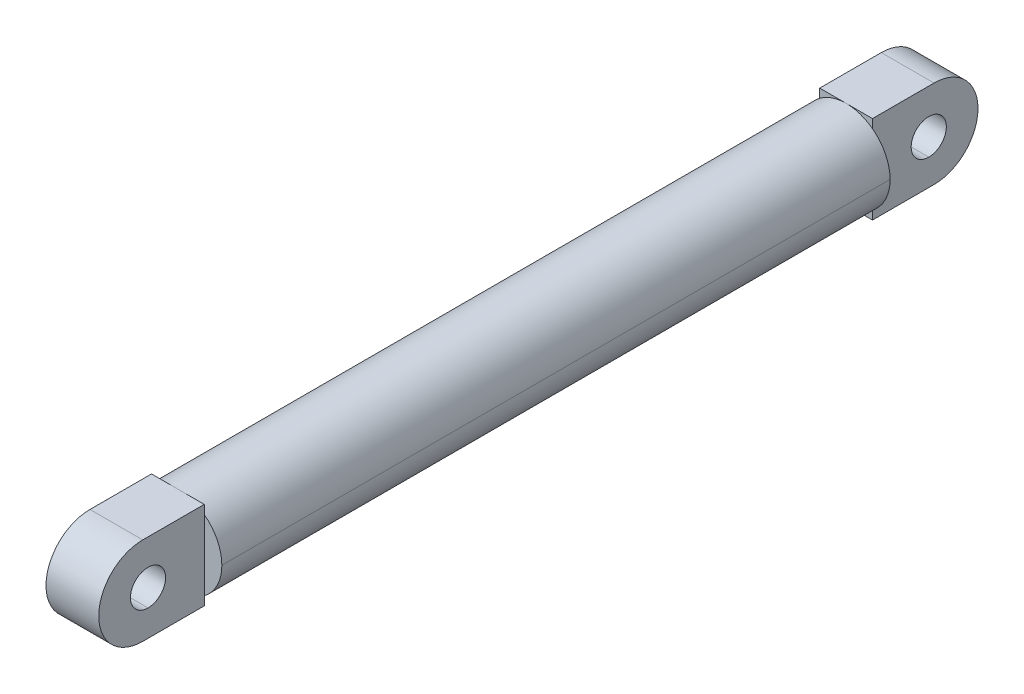
ISO-10303-21;
HEADER;
FILE_DESCRIPTION(('STEP AP214'),'2;1');
FILE_NAME('part.step','',(''),(''),'','','');
FILE_SCHEMA(('AUTOMOTIVE_DESIGN { 1 0 10303 214 1 1 1 1 }'));
ENDSEC;
DATA;
#1=APPLICATION_CONTEXT('core data for automotive mechanical design processes');
#2=APPLICATION_PROTOCOL_DEFINITION('international standard','automotive_design',2000,#1);
#3=PRODUCT_CONTEXT('',#1,'mechanical');
#4=PRODUCT('Part','Part','',(#3));
#5=PRODUCT_RELATED_PRODUCT_CATEGORY('part','',(#4));
#6=PRODUCT_DEFINITION_FORMATION('','',#4);
#7=PRODUCT_DEFINITION_CONTEXT('part definition',#1,'design');
#8=PRODUCT_DEFINITION('design','',#6,#7);
#9=PRODUCT_DEFINITION_SHAPE('','',#8);
#10=(LENGTH_UNIT() NAMED_UNIT(*) SI_UNIT(.MILLI.,.METRE.));
#11=(NAMED_UNIT(*) PLANE_ANGLE_UNIT() SI_UNIT($,.RADIAN.));
#12=(NAMED_UNIT(*) SI_UNIT($,.STERADIAN.) SOLID_ANGLE_UNIT());
#13=UNCERTAINTY_MEASURE_WITH_UNIT(LENGTH_MEASURE(1.E-05),#10,'distance_accuracy_value','');
#14=(GEOMETRIC_REPRESENTATION_CONTEXT(3) GLOBAL_UNCERTAINTY_ASSIGNED_CONTEXT((#13)) GLOBAL_UNIT_ASSIGNED_CONTEXT((#10,
#11,#12)) REPRESENTATION_CONTEXT('',''));
#15=CARTESIAN_POINT('',(0.,0.,0.));
#16=DIRECTION('',(0.,0.,1.));
#17=DIRECTION('',(1.,0.,0.));
#18=AXIS2_PLACEMENT_3D('',#15,#16,#17);
#19=CARTESIAN_POINT('',(-30.0000000000001,0.,28.));
#20=DIRECTION('',(1.,0.,0.));
#21=DIRECTION('',(0.,-1.,0.));
#22=AXIS2_PLACEMENT_3D('',#19,#20,#21);
#23=CYLINDRICAL_SURFACE('',#22,10.);
#24=DIRECTION('',(1.,0.,0.));
#25=VECTOR('',#24,1.);
#26=CARTESIAN_POINT('',(-15.,10.,28.));
#27=LINE('',#26,#25);
#28=CARTESIAN_POINT('',(-15.,10.,28.));
#29=VERTEX_POINT('',#28);
#30=CARTESIAN_POINT('',(15.,10.,28.));
#31=VERTEX_POINT('',#30);
#32=EDGE_CURVE('E20',#29,#31,#27,.T.);
#33=ORIENTED_EDGE('',*,*,#32,.T.);
#34=CARTESIAN_POINT('',(15.,0.,28.));
#35=DIRECTION('',(1.,0.,0.));
#36=DIRECTION('',(0.,1.,0.));
#37=AXIS2_PLACEMENT_3D('',#34,#35,#36);
#38=CIRCLE('',#37,10.);
#39=CARTESIAN_POINT('',(15.,-10.,28.));
#40=VERTEX_POINT('',#39);
#41=EDGE_CURVE('E295',#31,#40,#38,.T.);
#42=ORIENTED_EDGE('',*,*,#41,.T.);
#43=DIRECTION('',(1.,0.,0.));
#44=VECTOR('',#43,1.);
#45=CARTESIAN_POINT('',(-15.,-10.,28.));
#46=LINE('',#45,#44);
#47=CARTESIAN_POINT('',(-15.,-10.,28.));
#48=VERTEX_POINT('',#47);
#49=EDGE_CURVE('E11',#48,#40,#46,.T.);
#50=ORIENTED_EDGE('',*,*,#49,.F.);
#51=CARTESIAN_POINT('',(-15.,0.,28.));
#52=DIRECTION('',(1.,0.,0.));
#53=DIRECTION('',(0.,1.,0.));
#54=AXIS2_PLACEMENT_3D('',#51,#52,#53);
#55=CIRCLE('',#54,10.);
#56=EDGE_CURVE('E311',#29,#48,#55,.T.);
#57=ORIENTED_EDGE('',*,*,#56,.F.);
#58=EDGE_LOOP('',(#33,#42,#50,#57));
#59=FACE_BOUND('',#58,.T.);
#60=ADVANCED_FACE('F17',(#59),#23,.F.);
#61=CARTESIAN_POINT('',(-30.0000000000001,0.,28.));
#62=DIRECTION('',(1.,0.,0.));
#63=DIRECTION('',(0.,-1.,0.));
#64=AXIS2_PLACEMENT_3D('',#61,#62,#63);
#65=CYLINDRICAL_SURFACE('',#64,10.);
#66=ORIENTED_EDGE('',*,*,#49,.T.);
#67=CARTESIAN_POINT('',(15.,0.,28.));
#68=DIRECTION('',(1.,0.,0.));
#69=DIRECTION('',(0.,-1.,0.));
#70=AXIS2_PLACEMENT_3D('',#67,#68,#69);
#71=CIRCLE('',#70,10.);
#72=EDGE_CURVE('E303',#40,#31,#71,.T.);
#73=ORIENTED_EDGE('',*,*,#72,.T.);
#74=ORIENTED_EDGE('',*,*,#32,.F.);
#75=CARTESIAN_POINT('',(-15.,0.,28.));
#76=DIRECTION('',(1.,0.,0.));
#77=DIRECTION('',(0.,-1.,0.));
#78=AXIS2_PLACEMENT_3D('',#75,#76,#77);
#79=CIRCLE('',#78,10.);
#80=EDGE_CURVE('E320',#48,#29,#79,.T.);
#81=ORIENTED_EDGE('',*,*,#80,.F.);
#82=EDGE_LOOP('',(#66,#73,#74,#81));
#83=FACE_BOUND('',#82,.T.);
#84=ADVANCED_FACE('F341',(#83),#65,.F.);
#85=CARTESIAN_POINT('',(-25.,25.,60.));
#86=DIRECTION('',(0.,0.,1.));
#87=DIRECTION('',(0.,-1.,0.));
#88=AXIS2_PLACEMENT_3D('',#85,#86,#87);
#89=PLANE('',#88);
#90=CARTESIAN_POINT('',(0.,0.,60.));
#91=DIRECTION('',(0.,0.,1.));
#92=DIRECTION('',(0.,-1.,0.));
#93=AXIS2_PLACEMENT_3D('',#90,#91,#92);
#94=CIRCLE('',#93,25.);
#95=CARTESIAN_POINT('',(0.,-25.,60.));
#96=VERTEX_POINT('',#95);
#97=CARTESIAN_POINT('',(15.,-20.,60.));
#98=VERTEX_POINT('',#97);
#99=EDGE_CURVE('E219',#96,#98,#94,.T.);
#100=ORIENTED_EDGE('',*,*,#99,.F.);
#101=DIRECTION('',(1.,0.,0.));
#102=VECTOR('',#101,1.);
#103=CARTESIAN_POINT('',(0.,-25.,60.));
#104=LINE('',#103,#102);
#105=CARTESIAN_POINT('',(15.,-25.,60.));
#106=VERTEX_POINT('',#105);
#107=EDGE_CURVE('E323',#96,#106,#104,.T.);
#108=ORIENTED_EDGE('',*,*,#107,.T.);
#109=DIRECTION('',(0.,-1.,0.));
#110=VECTOR('',#109,1.);
#111=CARTESIAN_POINT('',(15.,-20.,60.));
#112=LINE('',#111,#110);
#113=EDGE_CURVE('E308',#98,#106,#112,.T.);
#114=ORIENTED_EDGE('',*,*,#113,.F.);
#115=EDGE_LOOP('',(#100,#108,#114));
#116=FACE_BOUND('',#115,.T.);
#117=ADVANCED_FACE('F404',(#116),#89,.T.);
#118=CARTESIAN_POINT('',(-25.,-25.,60.));
#119=DIRECTION('',(0.,-1.,0.));
#120=DIRECTION('',(0.,0.,-1.));
#121=AXIS2_PLACEMENT_3D('',#118,#119,#120);
#122=PLANE('',#121);
#123=DIRECTION('',(0.,0.,-1.));
#124=VECTOR('',#123,1.);
#125=CARTESIAN_POINT('',(15.,-25.,60.));
#126=LINE('',#125,#124);
#127=CARTESIAN_POINT('',(15.,-25.,25.));
#128=VERTEX_POINT('',#127);
#129=EDGE_CURVE('E291',#106,#128,#126,.T.);
#130=ORIENTED_EDGE('',*,*,#129,.F.);
#131=ORIENTED_EDGE('',*,*,#107,.F.);
#132=DIRECTION('',(1.,0.,0.));
#133=VECTOR('',#132,1.);
#134=CARTESIAN_POINT('',(-15.,-25.,60.));
#135=LINE('',#134,#133);
#136=CARTESIAN_POINT('',(-15.,-25.,60.));
#137=VERTEX_POINT('',#136);
#138=EDGE_CURVE('E314',#137,#96,#135,.T.);
#139=ORIENTED_EDGE('',*,*,#138,.F.);
#140=DIRECTION('',(0.,0.,-1.));
#141=VECTOR('',#140,1.);
#142=CARTESIAN_POINT('',(-15.,-25.,60.));
#143=LINE('',#142,#141);
#144=CARTESIAN_POINT('',(-15.,-25.,25.));
#145=VERTEX_POINT('',#144);
#146=EDGE_CURVE('E316',#137,#145,#143,.T.);
#147=ORIENTED_EDGE('',*,*,#146,.T.);
#148=DIRECTION('',(-1.,0.,0.));
#149=VECTOR('',#148,1.);
#150=CARTESIAN_POINT('',(15.,-25.,25.));
#151=LINE('',#150,#149);
#152=EDGE_CURVE('E294',#128,#145,#151,.T.);
#153=ORIENTED_EDGE('',*,*,#152,.F.);
#154=EDGE_LOOP('',(#130,#131,#139,#147,#153));
#155=FACE_BOUND('',#154,.T.);
#156=ADVANCED_FACE('F356',(#155),#122,.T.);
#157=CARTESIAN_POINT('',(-25.,25.,60.));
#158=DIRECTION('',(0.,0.,1.));
#159=DIRECTION('',(0.,-1.,0.));
#160=AXIS2_PLACEMENT_3D('',#157,#158,#159);
#161=PLANE('',#160);
#162=ORIENTED_EDGE('',*,*,#138,.T.);
#163=CARTESIAN_POINT('',(0.,0.,60.));
#164=DIRECTION('',(0.,0.,1.));
#165=DIRECTION('',(-0.6,-0.8,0.));
#166=AXIS2_PLACEMENT_3D('',#163,#164,#165);
#167=CIRCLE('',#166,25.);
#168=CARTESIAN_POINT('',(-15.,-20.,60.));
#169=VERTEX_POINT('',#168);
#170=EDGE_CURVE('E222',#169,#96,#167,.T.);
#171=ORIENTED_EDGE('',*,*,#170,.F.);
#172=DIRECTION('',(0.,-1.,0.));
#173=VECTOR('',#172,1.);
#174=CARTESIAN_POINT('',(-15.,-20.,60.));
#175=LINE('',#174,#173);
#176=EDGE_CURVE('E163',#169,#137,#175,.T.);
#177=ORIENTED_EDGE('',*,*,#176,.T.);
#178=EDGE_LOOP('',(#162,#171,#177));
#179=FACE_BOUND('',#178,.T.);
#180=ADVANCED_FACE('F359',(#179),#161,.T.);
#181=CARTESIAN_POINT('',(-25.,25.,60.));
#182=DIRECTION('',(0.,0.,1.));
#183=DIRECTION('',(0.,-1.,0.));
#184=AXIS2_PLACEMENT_3D('',#181,#182,#183);
#185=PLANE('',#184);
#186=CARTESIAN_POINT('',(0.,0.,60.));
#187=DIRECTION('',(0.,0.,1.));
#188=DIRECTION('',(0.,1.,0.));
#189=AXIS2_PLACEMENT_3D('',#186,#187,#188);
#190=CIRCLE('',#189,25.);
#191=CARTESIAN_POINT('',(0.,25.,60.));
#192=VERTEX_POINT('',#191);
#193=CARTESIAN_POINT('',(-15.,20.,60.));
#194=VERTEX_POINT('',#193);
#195=EDGE_CURVE('E156',#192,#194,#190,.T.);
#196=ORIENTED_EDGE('',*,*,#195,.F.);
#197=DIRECTION('',(1.,0.,0.));
#198=VECTOR('',#197,1.);
#199=CARTESIAN_POINT('',(-15.,25.,60.));
#200=LINE('',#199,#198);
#201=CARTESIAN_POINT('',(-15.,25.,60.));
#202=VERTEX_POINT('',#201);
#203=EDGE_CURVE('E159',#202,#192,#200,.T.);
#204=ORIENTED_EDGE('',*,*,#203,.F.);
#205=DIRECTION('',(0.,-1.,0.));
#206=VECTOR('',#205,1.);
#207=CARTESIAN_POINT('',(-15.,25.,60.));
#208=LINE('',#207,#206);
#209=EDGE_CURVE('E152',#202,#194,#208,.T.);
#210=ORIENTED_EDGE('',*,*,#209,.T.);
#211=EDGE_LOOP('',(#196,#204,#210));
#212=FACE_BOUND('',#211,.T.);
#213=ADVANCED_FACE('F154',(#212),#185,.T.);
#214=CARTESIAN_POINT('',(-25.,25.,60.));
#215=DIRECTION('',(0.,0.,1.));
#216=DIRECTION('',(0.,-1.,0.));
#217=AXIS2_PLACEMENT_3D('',#214,#215,#216);
#218=PLANE('',#217);
#219=DIRECTION('',(1.,0.,0.));
#220=VECTOR('',#219,1.);
#221=CARTESIAN_POINT('',(0.,25.,60.));
#222=LINE('',#221,#220);
#223=CARTESIAN_POINT('',(15.,25.,60.));
#224=VERTEX_POINT('',#223);
#225=EDGE_CURVE('E309',#192,#224,#222,.T.);
#226=ORIENTED_EDGE('',*,*,#225,.F.);
#227=CARTESIAN_POINT('',(0.,0.,60.));
#228=DIRECTION('',(0.,0.,1.));
#229=DIRECTION('',(0.6,0.8,0.));
#230=AXIS2_PLACEMENT_3D('',#227,#228,#229);
#231=CIRCLE('',#230,25.);
#232=CARTESIAN_POINT('',(15.,20.,60.));
#233=VERTEX_POINT('',#232);
#234=EDGE_CURVE('E188',#233,#192,#231,.T.);
#235=ORIENTED_EDGE('',*,*,#234,.F.);
#236=DIRECTION('',(0.,-1.,0.));
#237=VECTOR('',#236,1.);
#238=CARTESIAN_POINT('',(15.,25.,60.));
#239=LINE('',#238,#237);
#240=EDGE_CURVE('E304',#224,#233,#239,.T.);
#241=ORIENTED_EDGE('',*,*,#240,.F.);
#242=EDGE_LOOP('',(#226,#235,#241));
#243=FACE_BOUND('',#242,.T.);
#244=ADVANCED_FACE('F452',(#243),#218,.T.);
#245=CARTESIAN_POINT('',(-25.,25.,0.));
#246=DIRECTION('',(0.,1.,0.));
#247=DIRECTION('',(0.,0.,1.));
#248=AXIS2_PLACEMENT_3D('',#245,#246,#247);
#249=PLANE('',#248);
#250=DIRECTION('',(0.,0.,1.));
#251=VECTOR('',#250,1.);
#252=CARTESIAN_POINT('',(-15.,25.,25.));
#253=LINE('',#252,#251);
#254=CARTESIAN_POINT('',(-15.,25.,25.));
#255=VERTEX_POINT('',#254);
#256=EDGE_CURVE('E164',#255,#202,#253,.T.);
#257=ORIENTED_EDGE('',*,*,#256,.T.);
#258=ORIENTED_EDGE('',*,*,#203,.T.);
#259=ORIENTED_EDGE('',*,*,#225,.T.);
#260=DIRECTION('',(0.,0.,1.));
#261=VECTOR('',#260,1.);
#262=CARTESIAN_POINT('',(15.,25.,25.));
#263=LINE('',#262,#261);
#264=CARTESIAN_POINT('',(15.,25.,25.));
#265=VERTEX_POINT('',#264);
#266=EDGE_CURVE('E300',#265,#224,#263,.T.);
#267=ORIENTED_EDGE('',*,*,#266,.F.);
#268=DIRECTION('',(1.,0.,0.));
#269=VECTOR('',#268,1.);
#270=CARTESIAN_POINT('',(-15.,25.,25.));
#271=LINE('',#270,#269);
#272=EDGE_CURVE('E297',#255,#265,#271,.T.);
#273=ORIENTED_EDGE('',*,*,#272,.F.);
#274=EDGE_LOOP('',(#257,#258,#259,#267,#273));
#275=FACE_BOUND('',#274,.T.);
#276=ADVANCED_FACE('F351',(#275),#249,.T.);
#277=CARTESIAN_POINT('',(-15.,30.,60.));
#278=DIRECTION('',(1.,0.,0.));
#279=DIRECTION('',(0.,0.,-1.));
#280=AXIS2_PLACEMENT_3D('',#277,#278,#279);
#281=PLANE('',#280);
#282=ORIENTED_EDGE('',*,*,#56,.T.);
#283=ORIENTED_EDGE('',*,*,#80,.T.);
#284=EDGE_LOOP('',(#282,#283));
#285=FACE_BOUND('',#284,.T.);
#286=ORIENTED_EDGE('',*,*,#146,.F.);
#287=ORIENTED_EDGE('',*,*,#176,.F.);
#288=DIRECTION('',(0.,-1.,0.));
#289=VECTOR('',#288,1.);
#290=CARTESIAN_POINT('',(-15.,20.,60.));
#291=LINE('',#290,#289);
#292=EDGE_CURVE('E168',#194,#169,#291,.T.);
#293=ORIENTED_EDGE('',*,*,#292,.F.);
#294=ORIENTED_EDGE('',*,*,#209,.F.);
#295=ORIENTED_EDGE('',*,*,#256,.F.);
#296=CARTESIAN_POINT('',(-15.,0.,25.));
#297=DIRECTION('',(1.,0.,0.));
#298=DIRECTION('',(0.,-1.,0.));
#299=AXIS2_PLACEMENT_3D('',#296,#297,#298);
#300=CIRCLE('',#299,25.);
#301=EDGE_CURVE('E292',#145,#255,#300,.T.);
#302=ORIENTED_EDGE('',*,*,#301,.F.);
#303=EDGE_LOOP('',(#286,#287,#293,#294,#295,#302));
#304=FACE_BOUND('',#303,.T.);
#305=ADVANCED_FACE('F171',(#285,#304),#281,.F.);
#306=CARTESIAN_POINT('',(-90.1800000000001,0.,25.));
#307=DIRECTION('',(1.,0.,0.));
#308=DIRECTION('',(0.,0.,-1.));
#309=AXIS2_PLACEMENT_3D('',#306,#307,#308);
#310=CYLINDRICAL_SURFACE('',#309,25.);
#311=ORIENTED_EDGE('',*,*,#272,.T.);
#312=CARTESIAN_POINT('',(15.,0.,25.));
#313=DIRECTION('',(-1.,0.,0.));
#314=DIRECTION('',(0.,1.,0.));
#315=AXIS2_PLACEMENT_3D('',#312,#313,#314);
#316=CIRCLE('',#315,25.);
#317=EDGE_CURVE('E288',#265,#128,#316,.T.);
#318=ORIENTED_EDGE('',*,*,#317,.T.);
#319=ORIENTED_EDGE('',*,*,#152,.T.);
#320=ORIENTED_EDGE('',*,*,#301,.T.);
#321=EDGE_LOOP('',(#311,#318,#319,#320));
#322=FACE_BOUND('',#321,.T.);
#323=ADVANCED_FACE('F346',(#322),#310,.T.);
#324=CARTESIAN_POINT('',(15.,30.,0.));
#325=DIRECTION('',(-1.,0.,0.));
#326=DIRECTION('',(0.,0.,1.));
#327=AXIS2_PLACEMENT_3D('',#324,#325,#326);
#328=PLANE('',#327);
#329=ORIENTED_EDGE('',*,*,#41,.F.);
#330=ORIENTED_EDGE('',*,*,#72,.F.);
#331=EDGE_LOOP('',(#329,#330));
#332=FACE_BOUND('',#331,.T.);
#333=ORIENTED_EDGE('',*,*,#266,.T.);
#334=ORIENTED_EDGE('',*,*,#240,.T.);
#335=DIRECTION('',(0.,-1.,0.));
#336=VECTOR('',#335,1.);
#337=CARTESIAN_POINT('',(15.,20.,60.));
#338=LINE('',#337,#336);
#339=EDGE_CURVE('E284',#233,#98,#338,.T.);
#340=ORIENTED_EDGE('',*,*,#339,.T.);
#341=ORIENTED_EDGE('',*,*,#113,.T.);
#342=ORIENTED_EDGE('',*,*,#129,.T.);
#343=ORIENTED_EDGE('',*,*,#317,.F.);
#344=EDGE_LOOP('',(#333,#334,#340,#341,#342,#343));
#345=FACE_BOUND('',#344,.T.);
#346=ADVANCED_FACE('F342',(#332,#345),#328,.F.);
#347=CARTESIAN_POINT('',(15.,30.,60.));
#348=DIRECTION('',(0.,0.,1.));
#349=DIRECTION('',(1.,0.,0.));
#350=AXIS2_PLACEMENT_3D('',#347,#348,#349);
#351=PLANE('',#350);
#352=CARTESIAN_POINT('',(0.,0.,60.));
#353=DIRECTION('',(0.,0.,1.));
#354=DIRECTION('',(0.6,-0.8,0.));
#355=AXIS2_PLACEMENT_3D('',#352,#353,#354);
#356=CIRCLE('',#355,25.);
#357=CARTESIAN_POINT('',(25.,0.,60.));
#358=VERTEX_POINT('',#357);
#359=EDGE_CURVE('E216',#98,#358,#356,.T.);
#360=ORIENTED_EDGE('',*,*,#359,.F.);
#361=ORIENTED_EDGE('',*,*,#339,.F.);
#362=CARTESIAN_POINT('',(0.,0.,60.));
#363=DIRECTION('',(0.,0.,1.));
#364=DIRECTION('',(1.,0.,0.));
#365=AXIS2_PLACEMENT_3D('',#362,#363,#364);
#366=CIRCLE('',#365,25.);
#367=EDGE_CURVE('E190',#358,#233,#366,.T.);
#368=ORIENTED_EDGE('',*,*,#367,.F.);
#369=EDGE_LOOP('',(#360,#361,#368));
#370=FACE_BOUND('',#369,.T.);
#371=ADVANCED_FACE('F345',(#370),#351,.F.);
#372=CARTESIAN_POINT('',(-30.0000000000001,0.,472.));
#373=DIRECTION('',(1.,0.,0.));
#374=DIRECTION('',(0.,-1.,0.));
#375=AXIS2_PLACEMENT_3D('',#372,#373,#374);
#376=CYLINDRICAL_SURFACE('',#375,10.);
#377=DIRECTION('',(1.,0.,0.));
#378=VECTOR('',#377,1.);
#379=CARTESIAN_POINT('',(-15.,-10.,472.));
#380=LINE('',#379,#378);
#381=CARTESIAN_POINT('',(-15.,-10.,472.));
#382=VERTEX_POINT('',#381);
#383=CARTESIAN_POINT('',(15.,-10.,472.));
#384=VERTEX_POINT('',#383);
#385=EDGE_CURVE('E37',#382,#384,#380,.T.);
#386=ORIENTED_EDGE('',*,*,#385,.F.);
#387=CARTESIAN_POINT('',(-15.,0.,472.));
#388=DIRECTION('',(1.,0.,0.));
#389=DIRECTION('',(0.,1.,0.));
#390=AXIS2_PLACEMENT_3D('',#387,#388,#389);
#391=CIRCLE('',#390,10.);
#392=CARTESIAN_POINT('',(-15.,10.,472.));
#393=VERTEX_POINT('',#392);
#394=EDGE_CURVE('E32',#393,#382,#391,.T.);
#395=ORIENTED_EDGE('',*,*,#394,.F.);
#396=DIRECTION('',(1.,0.,0.));
#397=VECTOR('',#396,1.);
#398=CARTESIAN_POINT('',(-15.,10.,472.));
#399=LINE('',#398,#397);
#400=CARTESIAN_POINT('',(15.,10.,472.));
#401=VERTEX_POINT('',#400);
#402=EDGE_CURVE('E279',#393,#401,#399,.T.);
#403=ORIENTED_EDGE('',*,*,#402,.T.);
#404=CARTESIAN_POINT('',(15.,0.,472.));
#405=DIRECTION('',(1.,0.,0.));
#406=DIRECTION('',(0.,1.,0.));
#407=AXIS2_PLACEMENT_3D('',#404,#405,#406);
#408=CIRCLE('',#407,10.);
#409=EDGE_CURVE('E265',#401,#384,#408,.T.);
#410=ORIENTED_EDGE('',*,*,#409,.T.);
#411=EDGE_LOOP('',(#386,#395,#403,#410));
#412=FACE_BOUND('',#411,.T.);
#413=ADVANCED_FACE('F501',(#412),#376,.F.);
#414=CARTESIAN_POINT('',(-30.0000000000001,0.,472.));
#415=DIRECTION('',(1.,0.,0.));
#416=DIRECTION('',(0.,-1.,0.));
#417=AXIS2_PLACEMENT_3D('',#414,#415,#416);
#418=CYLINDRICAL_SURFACE('',#417,10.);
#419=ORIENTED_EDGE('',*,*,#402,.F.);
#420=CARTESIAN_POINT('',(-15.,0.,472.));
#421=DIRECTION('',(1.,0.,0.));
#422=DIRECTION('',(0.,-1.,0.));
#423=AXIS2_PLACEMENT_3D('',#420,#421,#422);
#424=CIRCLE('',#423,10.);
#425=EDGE_CURVE('E238',#382,#393,#424,.T.);
#426=ORIENTED_EDGE('',*,*,#425,.F.);
#427=ORIENTED_EDGE('',*,*,#385,.T.);
#428=CARTESIAN_POINT('',(15.,0.,472.));
#429=DIRECTION('',(1.,0.,0.));
#430=DIRECTION('',(0.,-1.,0.));
#431=AXIS2_PLACEMENT_3D('',#428,#429,#430);
#432=CIRCLE('',#431,10.);
#433=EDGE_CURVE('E270',#384,#401,#432,.T.);
#434=ORIENTED_EDGE('',*,*,#433,.T.);
#435=EDGE_LOOP('',(#419,#426,#427,#434));
#436=FACE_BOUND('',#435,.T.);
#437=ADVANCED_FACE('F510',(#436),#418,.F.);
#438=CARTESIAN_POINT('',(-25.,-25.,440.));
#439=DIRECTION('',(0.,0.,-1.));
#440=DIRECTION('',(0.,1.,0.));
#441=AXIS2_PLACEMENT_3D('',#438,#439,#440);
#442=PLANE('',#441);
#443=CARTESIAN_POINT('',(0.,0.,440.));
#444=DIRECTION('',(0.,0.,1.));
#445=DIRECTION('',(-0.6,-0.8,0.));
#446=AXIS2_PLACEMENT_3D('',#443,#444,#445);
#447=CIRCLE('',#446,25.);
#448=CARTESIAN_POINT('',(-15.,-20.,440.));
#449=VERTEX_POINT('',#448);
#450=CARTESIAN_POINT('',(0.,-25.,440.));
#451=VERTEX_POINT('',#450);
#452=EDGE_CURVE('E210',#449,#451,#447,.T.);
#453=ORIENTED_EDGE('',*,*,#452,.T.);
#454=DIRECTION('',(1.,0.,0.));
#455=VECTOR('',#454,1.);
#456=CARTESIAN_POINT('',(-15.,-25.,440.));
#457=LINE('',#456,#455);
#458=CARTESIAN_POINT('',(-15.,-25.,440.));
#459=VERTEX_POINT('',#458);
#460=EDGE_CURVE('E264',#459,#451,#457,.T.);
#461=ORIENTED_EDGE('',*,*,#460,.F.);
#462=DIRECTION('',(0.,1.,0.));
#463=VECTOR('',#462,1.);
#464=CARTESIAN_POINT('',(-15.,-25.,440.));
#465=LINE('',#464,#463);
#466=EDGE_CURVE('E251',#459,#449,#465,.T.);
#467=ORIENTED_EDGE('',*,*,#466,.T.);
#468=EDGE_LOOP('',(#453,#461,#467));
#469=FACE_BOUND('',#468,.T.);
#470=ADVANCED_FACE('F519',(#469),#442,.T.);
#471=CARTESIAN_POINT('',(-25.,-25.,500.));
#472=DIRECTION('',(0.,-1.,0.));
#473=DIRECTION('',(0.,0.,-1.));
#474=AXIS2_PLACEMENT_3D('',#471,#472,#473);
#475=PLANE('',#474);
#476=DIRECTION('',(0.,0.,-1.));
#477=VECTOR('',#476,1.);
#478=CARTESIAN_POINT('',(-15.,-25.,475.));
#479=LINE('',#478,#477);
#480=CARTESIAN_POINT('',(-15.,-25.,475.));
#481=VERTEX_POINT('',#480);
#482=EDGE_CURVE('E231',#481,#459,#479,.T.);
#483=ORIENTED_EDGE('',*,*,#482,.T.);
#484=ORIENTED_EDGE('',*,*,#460,.T.);
#485=DIRECTION('',(1.,0.,0.));
#486=VECTOR('',#485,1.);
#487=CARTESIAN_POINT('',(0.,-25.,440.));
#488=LINE('',#487,#486);
#489=CARTESIAN_POINT('',(15.,-25.,440.));
#490=VERTEX_POINT('',#489);
#491=EDGE_CURVE('E262',#451,#490,#488,.T.);
#492=ORIENTED_EDGE('',*,*,#491,.T.);
#493=DIRECTION('',(0.,0.,-1.));
#494=VECTOR('',#493,1.);
#495=CARTESIAN_POINT('',(15.,-25.,475.));
#496=LINE('',#495,#494);
#497=CARTESIAN_POINT('',(15.,-25.,475.));
#498=VERTEX_POINT('',#497);
#499=EDGE_CURVE('E261',#498,#490,#496,.T.);
#500=ORIENTED_EDGE('',*,*,#499,.F.);
#501=DIRECTION('',(1.,0.,0.));
#502=VECTOR('',#501,1.);
#503=CARTESIAN_POINT('',(-15.,-25.,475.));
#504=LINE('',#503,#502);
#505=EDGE_CURVE('E244',#481,#498,#504,.T.);
#506=ORIENTED_EDGE('',*,*,#505,.F.);
#507=EDGE_LOOP('',(#483,#484,#492,#500,#506));
#508=FACE_BOUND('',#507,.T.);
#509=ADVANCED_FACE('F529',(#508),#475,.T.);
#510=CARTESIAN_POINT('',(-25.,-25.,440.));
#511=DIRECTION('',(0.,0.,-1.));
#512=DIRECTION('',(0.,1.,0.));
#513=AXIS2_PLACEMENT_3D('',#510,#511,#512);
#514=PLANE('',#513);
#515=ORIENTED_EDGE('',*,*,#491,.F.);
#516=CARTESIAN_POINT('',(0.,0.,440.));
#517=DIRECTION('',(0.,0.,1.));
#518=DIRECTION('',(0.,-1.,0.));
#519=AXIS2_PLACEMENT_3D('',#516,#517,#518);
#520=CIRCLE('',#519,25.);
#521=CARTESIAN_POINT('',(15.,-20.,440.));
#522=VERTEX_POINT('',#521);
#523=EDGE_CURVE('E212',#451,#522,#520,.T.);
#524=ORIENTED_EDGE('',*,*,#523,.T.);
#525=DIRECTION('',(0.,1.,0.));
#526=VECTOR('',#525,1.);
#527=CARTESIAN_POINT('',(15.,-25.,440.));
#528=LINE('',#527,#526);
#529=EDGE_CURVE('E258',#490,#522,#528,.T.);
#530=ORIENTED_EDGE('',*,*,#529,.F.);
#531=EDGE_LOOP('',(#515,#524,#530));
#532=FACE_BOUND('',#531,.T.);
#533=ADVANCED_FACE('F539',(#532),#514,.T.);
#534=CARTESIAN_POINT('',(25.,30.,440.));
#535=DIRECTION('',(0.,0.,-1.));
#536=DIRECTION('',(-1.,0.,0.));
#537=AXIS2_PLACEMENT_3D('',#534,#535,#536);
#538=PLANE('',#537);
#539=DIRECTION('',(0.,-1.,0.));
#540=VECTOR('',#539,1.);
#541=CARTESIAN_POINT('',(15.,20.,440.));
#542=LINE('',#541,#540);
#543=CARTESIAN_POINT('',(15.,20.,440.));
#544=VERTEX_POINT('',#543);
#545=EDGE_CURVE('E253',#544,#522,#542,.T.);
#546=ORIENTED_EDGE('',*,*,#545,.T.);
#547=CARTESIAN_POINT('',(0.,0.,440.));
#548=DIRECTION('',(0.,0.,1.));
#549=DIRECTION('',(0.6,-0.8,0.));
#550=AXIS2_PLACEMENT_3D('',#547,#548,#549);
#551=CIRCLE('',#550,25.);
#552=CARTESIAN_POINT('',(25.,0.,440.));
#553=VERTEX_POINT('',#552);
#554=EDGE_CURVE('E214',#522,#553,#551,.T.);
#555=ORIENTED_EDGE('',*,*,#554,.T.);
#556=CARTESIAN_POINT('',(0.,0.,440.));
#557=DIRECTION('',(0.,0.,1.));
#558=DIRECTION('',(1.,0.,0.));
#559=AXIS2_PLACEMENT_3D('',#556,#557,#558);
#560=CIRCLE('',#559,25.);
#561=EDGE_CURVE('E197',#553,#544,#560,.T.);
#562=ORIENTED_EDGE('',*,*,#561,.T.);
#563=EDGE_LOOP('',(#546,#555,#562));
#564=FACE_BOUND('',#563,.T.);
#565=ADVANCED_FACE('F392',(#564),#538,.F.);
#566=CARTESIAN_POINT('',(15.,30.,440.));
#567=DIRECTION('',(-1.,0.,0.));
#568=DIRECTION('',(0.,0.,1.));
#569=AXIS2_PLACEMENT_3D('',#566,#567,#568);
#570=PLANE('',#569);
#571=ORIENTED_EDGE('',*,*,#409,.F.);
#572=ORIENTED_EDGE('',*,*,#433,.F.);
#573=EDGE_LOOP('',(#571,#572));
#574=FACE_BOUND('',#573,.T.);
#575=ORIENTED_EDGE('',*,*,#499,.T.);
#576=ORIENTED_EDGE('',*,*,#529,.T.);
#577=ORIENTED_EDGE('',*,*,#545,.F.);
#578=DIRECTION('',(0.,1.,0.));
#579=VECTOR('',#578,1.);
#580=CARTESIAN_POINT('',(15.,20.,440.));
#581=LINE('',#580,#579);
#582=CARTESIAN_POINT('',(15.,25.,440.));
#583=VERTEX_POINT('',#582);
#584=EDGE_CURVE('E249',#544,#583,#581,.T.);
#585=ORIENTED_EDGE('',*,*,#584,.T.);
#586=DIRECTION('',(0.,0.,1.));
#587=VECTOR('',#586,1.);
#588=CARTESIAN_POINT('',(15.,25.,440.));
#589=LINE('',#588,#587);
#590=CARTESIAN_POINT('',(15.,25.,475.));
#591=VERTEX_POINT('',#590);
#592=EDGE_CURVE('E247',#583,#591,#589,.T.);
#593=ORIENTED_EDGE('',*,*,#592,.T.);
#594=CARTESIAN_POINT('',(15.,0.,475.));
#595=DIRECTION('',(-1.,0.,0.));
#596=DIRECTION('',(0.,-1.,0.));
#597=AXIS2_PLACEMENT_3D('',#594,#595,#596);
#598=CIRCLE('',#597,25.);
#599=EDGE_CURVE('E235',#498,#591,#598,.T.);
#600=ORIENTED_EDGE('',*,*,#599,.F.);
#601=EDGE_LOOP('',(#575,#576,#577,#585,#593,#600));
#602=FACE_BOUND('',#601,.T.);
#603=ADVANCED_FACE('F395',(#574,#602),#570,.F.);
#604=CARTESIAN_POINT('',(-25.,-25.,440.));
#605=DIRECTION('',(0.,0.,-1.));
#606=DIRECTION('',(0.,1.,0.));
#607=AXIS2_PLACEMENT_3D('',#604,#605,#606);
#608=PLANE('',#607);
#609=CARTESIAN_POINT('',(0.,0.,440.));
#610=DIRECTION('',(0.,0.,1.));
#611=DIRECTION('',(0.6,0.8,0.));
#612=AXIS2_PLACEMENT_3D('',#609,#610,#611);
#613=CIRCLE('',#612,25.);
#614=CARTESIAN_POINT('',(0.,25.,440.));
#615=VERTEX_POINT('',#614);
#616=EDGE_CURVE('E199',#544,#615,#613,.T.);
#617=ORIENTED_EDGE('',*,*,#616,.T.);
#618=DIRECTION('',(1.,0.,0.));
#619=VECTOR('',#618,1.);
#620=CARTESIAN_POINT('',(0.,25.,440.));
#621=LINE('',#620,#619);
#622=EDGE_CURVE('E243',#615,#583,#621,.T.);
#623=ORIENTED_EDGE('',*,*,#622,.T.);
#624=ORIENTED_EDGE('',*,*,#584,.F.);
#625=EDGE_LOOP('',(#617,#623,#624));
#626=FACE_BOUND('',#625,.T.);
#627=ADVANCED_FACE('F387',(#626),#608,.T.);
#628=CARTESIAN_POINT('',(-25.,-25.,440.));
#629=DIRECTION('',(0.,0.,-1.));
#630=DIRECTION('',(0.,1.,0.));
#631=AXIS2_PLACEMENT_3D('',#628,#629,#630);
#632=PLANE('',#631);
#633=DIRECTION('',(1.,0.,0.));
#634=VECTOR('',#633,1.);
#635=CARTESIAN_POINT('',(-15.,25.,440.));
#636=LINE('',#635,#634);
#637=CARTESIAN_POINT('',(-15.,25.,440.));
#638=VERTEX_POINT('',#637);
#639=EDGE_CURVE('E240',#638,#615,#636,.T.);
#640=ORIENTED_EDGE('',*,*,#639,.T.);
#641=CARTESIAN_POINT('',(0.,0.,440.));
#642=DIRECTION('',(0.,0.,1.));
#643=DIRECTION('',(0.,1.,0.));
#644=AXIS2_PLACEMENT_3D('',#641,#642,#643);
#645=CIRCLE('',#644,25.);
#646=CARTESIAN_POINT('',(-15.,20.,440.));
#647=VERTEX_POINT('',#646);
#648=EDGE_CURVE('E201',#615,#647,#645,.T.);
#649=ORIENTED_EDGE('',*,*,#648,.T.);
#650=DIRECTION('',(0.,1.,0.));
#651=VECTOR('',#650,1.);
#652=CARTESIAN_POINT('',(-15.,20.,440.));
#653=LINE('',#652,#651);
#654=EDGE_CURVE('E239',#647,#638,#653,.T.);
#655=ORIENTED_EDGE('',*,*,#654,.T.);
#656=EDGE_LOOP('',(#640,#649,#655));
#657=FACE_BOUND('',#656,.T.);
#658=ADVANCED_FACE('F379',(#657),#632,.T.);
#659=CARTESIAN_POINT('',(-25.,25.,440.));
#660=DIRECTION('',(0.,1.,0.));
#661=DIRECTION('',(0.,0.,1.));
#662=AXIS2_PLACEMENT_3D('',#659,#660,#661);
#663=PLANE('',#662);
#664=ORIENTED_EDGE('',*,*,#592,.F.);
#665=ORIENTED_EDGE('',*,*,#622,.F.);
#666=ORIENTED_EDGE('',*,*,#639,.F.);
#667=DIRECTION('',(0.,0.,1.));
#668=VECTOR('',#667,1.);
#669=CARTESIAN_POINT('',(-15.,25.,440.));
#670=LINE('',#669,#668);
#671=CARTESIAN_POINT('',(-15.,25.,475.));
#672=VERTEX_POINT('',#671);
#673=EDGE_CURVE('E236',#638,#672,#670,.T.);
#674=ORIENTED_EDGE('',*,*,#673,.T.);
#675=DIRECTION('',(-1.,0.,0.));
#676=VECTOR('',#675,1.);
#677=CARTESIAN_POINT('',(15.,25.,475.));
#678=LINE('',#677,#676);
#679=EDGE_CURVE('E232',#591,#672,#678,.T.);
#680=ORIENTED_EDGE('',*,*,#679,.F.);
#681=EDGE_LOOP('',(#664,#665,#666,#674,#680));
#682=FACE_BOUND('',#681,.T.);
#683=ADVANCED_FACE('F383',(#682),#663,.T.);
#684=CARTESIAN_POINT('',(-90.1800000000001,0.,475.));
#685=DIRECTION('',(1.,0.,0.));
#686=DIRECTION('',(0.,0.,1.));
#687=AXIS2_PLACEMENT_3D('',#684,#685,#686);
#688=CYLINDRICAL_SURFACE('',#687,25.);
#689=ORIENTED_EDGE('',*,*,#505,.T.);
#690=ORIENTED_EDGE('',*,*,#599,.T.);
#691=ORIENTED_EDGE('',*,*,#679,.T.);
#692=CARTESIAN_POINT('',(-15.,0.,475.));
#693=DIRECTION('',(1.,0.,0.));
#694=DIRECTION('',(0.,1.,0.));
#695=AXIS2_PLACEMENT_3D('',#692,#693,#694);
#696=CIRCLE('',#695,25.);
#697=EDGE_CURVE('E228',#672,#481,#696,.T.);
#698=ORIENTED_EDGE('',*,*,#697,.T.);
#699=EDGE_LOOP('',(#689,#690,#691,#698));
#700=FACE_BOUND('',#699,.T.);
#701=ADVANCED_FACE('F590',(#700),#688,.T.);
#702=CARTESIAN_POINT('',(-15.,30.,500.));
#703=DIRECTION('',(1.,0.,0.));
#704=DIRECTION('',(0.,0.,-1.));
#705=AXIS2_PLACEMENT_3D('',#702,#703,#704);
#706=PLANE('',#705);
#707=ORIENTED_EDGE('',*,*,#394,.T.);
#708=ORIENTED_EDGE('',*,*,#425,.T.);
#709=EDGE_LOOP('',(#707,#708));
#710=FACE_BOUND('',#709,.T.);
#711=ORIENTED_EDGE('',*,*,#673,.F.);
#712=ORIENTED_EDGE('',*,*,#654,.F.);
#713=DIRECTION('',(0.,-1.,0.));
#714=VECTOR('',#713,1.);
#715=CARTESIAN_POINT('',(-15.,20.,440.));
#716=LINE('',#715,#714);
#717=EDGE_CURVE('E225',#647,#449,#716,.T.);
#718=ORIENTED_EDGE('',*,*,#717,.T.);
#719=ORIENTED_EDGE('',*,*,#466,.F.);
#720=ORIENTED_EDGE('',*,*,#482,.F.);
#721=ORIENTED_EDGE('',*,*,#697,.F.);
#722=EDGE_LOOP('',(#711,#712,#718,#719,#720,#721));
#723=FACE_BOUND('',#722,.T.);
#724=ADVANCED_FACE('F374',(#710,#723),#706,.F.);
#725=CARTESIAN_POINT('',(-15.,30.,440.));
#726=DIRECTION('',(0.,0.,-1.));
#727=DIRECTION('',(-1.,0.,0.));
#728=AXIS2_PLACEMENT_3D('',#725,#726,#727);
#729=PLANE('',#728);
#730=CARTESIAN_POINT('',(0.,0.,440.));
#731=DIRECTION('',(0.,0.,1.));
#732=DIRECTION('',(-1.,0.,0.));
#733=AXIS2_PLACEMENT_3D('',#730,#731,#732);
#734=CIRCLE('',#733,25.);
#735=CARTESIAN_POINT('',(-25.,0.,440.));
#736=VERTEX_POINT('',#735);
#737=EDGE_CURVE('E176',#736,#449,#734,.T.);
#738=ORIENTED_EDGE('',*,*,#737,.T.);
#739=ORIENTED_EDGE('',*,*,#717,.F.);
#740=CARTESIAN_POINT('',(0.,0.,440.));
#741=DIRECTION('',(0.,0.,1.));
#742=DIRECTION('',(-0.6,0.8,0.));
#743=AXIS2_PLACEMENT_3D('',#740,#741,#742);
#744=CIRCLE('',#743,25.);
#745=EDGE_CURVE('E203',#647,#736,#744,.T.);
#746=ORIENTED_EDGE('',*,*,#745,.T.);
#747=EDGE_LOOP('',(#738,#739,#746));
#748=FACE_BOUND('',#747,.T.);
#749=ADVANCED_FACE('F369',(#748),#729,.F.);
#750=CARTESIAN_POINT('',(0.,0.,0.));
#751=DIRECTION('',(0.,0.,1.));
#752=DIRECTION('',(1.,0.,0.));
#753=AXIS2_PLACEMENT_3D('',#750,#751,#752);
#754=CYLINDRICAL_SURFACE('',#753,25.);
#755=ORIENTED_EDGE('',*,*,#170,.T.);
#756=ORIENTED_EDGE('',*,*,#99,.T.);
#757=ORIENTED_EDGE('',*,*,#359,.T.);
#758=DIRECTION('',(0.,0.,1.));
#759=VECTOR('',#758,1.);
#760=CARTESIAN_POINT('',(25.,0.,60.));
#761=LINE('',#760,#759);
#762=EDGE_CURVE('E194',#358,#553,#761,.T.);
#763=ORIENTED_EDGE('',*,*,#762,.T.);
#764=ORIENTED_EDGE('',*,*,#554,.F.);
#765=ORIENTED_EDGE('',*,*,#523,.F.);
#766=ORIENTED_EDGE('',*,*,#452,.F.);
#767=ORIENTED_EDGE('',*,*,#737,.F.);
#768=DIRECTION('',(0.,0.,1.));
#769=VECTOR('',#768,1.);
#770=CARTESIAN_POINT('',(-25.,0.,60.));
#771=LINE('',#770,#769);
#772=CARTESIAN_POINT('',(-25.,0.,60.));
#773=VERTEX_POINT('',#772);
#774=EDGE_CURVE('E205',#773,#736,#771,.T.);
#775=ORIENTED_EDGE('',*,*,#774,.F.);
#776=CARTESIAN_POINT('',(0.,0.,60.));
#777=DIRECTION('',(0.,0.,1.));
#778=DIRECTION('',(-1.,0.,0.));
#779=AXIS2_PLACEMENT_3D('',#776,#777,#778);
#780=CIRCLE('',#779,25.);
#781=EDGE_CURVE('E177',#773,#169,#780,.T.);
#782=ORIENTED_EDGE('',*,*,#781,.T.);
#783=EDGE_LOOP('',(#755,#756,#757,#763,#764,#765,#766,#767,#775,#782));
#784=FACE_BOUND('',#783,.T.);
#785=ADVANCED_FACE('F361',(#784),#754,.T.);
#786=CARTESIAN_POINT('',(-25.,30.,60.));
#787=DIRECTION('',(0.,0.,1.));
#788=DIRECTION('',(1.,0.,0.));
#789=AXIS2_PLACEMENT_3D('',#786,#787,#788);
#790=PLANE('',#789);
#791=ORIENTED_EDGE('',*,*,#292,.T.);
#792=ORIENTED_EDGE('',*,*,#781,.F.);
#793=CARTESIAN_POINT('',(0.,0.,60.));
#794=DIRECTION('',(0.,0.,1.));
#795=DIRECTION('',(-0.6,0.8,0.));
#796=AXIS2_PLACEMENT_3D('',#793,#794,#795);
#797=CIRCLE('',#796,25.);
#798=EDGE_CURVE('E180',#194,#773,#797,.T.);
#799=ORIENTED_EDGE('',*,*,#798,.F.);
#800=EDGE_LOOP('',(#791,#792,#799));
#801=FACE_BOUND('',#800,.T.);
#802=ADVANCED_FACE('F181',(#801),#790,.F.);
#803=CARTESIAN_POINT('',(0.,0.,0.));
#804=DIRECTION('',(0.,0.,1.));
#805=DIRECTION('',(1.,0.,0.));
#806=AXIS2_PLACEMENT_3D('',#803,#804,#805);
#807=CYLINDRICAL_SURFACE('',#806,25.);
#808=ORIENTED_EDGE('',*,*,#774,.T.);
#809=ORIENTED_EDGE('',*,*,#745,.F.);
#810=ORIENTED_EDGE('',*,*,#648,.F.);
#811=ORIENTED_EDGE('',*,*,#616,.F.);
#812=ORIENTED_EDGE('',*,*,#561,.F.);
#813=ORIENTED_EDGE('',*,*,#762,.F.);
#814=ORIENTED_EDGE('',*,*,#367,.T.);
#815=ORIENTED_EDGE('',*,*,#234,.T.);
#816=ORIENTED_EDGE('',*,*,#195,.T.);
#817=ORIENTED_EDGE('',*,*,#798,.T.);
#818=EDGE_LOOP('',(#808,#809,#810,#811,#812,#813,#814,#815,#816,#817));
#819=FACE_BOUND('',#818,.T.);
#820=ADVANCED_FACE('F186',(#819),#807,.T.);
#821=CLOSED_SHELL('',(#60,#84,#117,#156,#180,#213,#244,#276,#305,#323,#346,#371,#413,#437,#470,
#509,#533,#565,#603,#627,#658,#683,#701,#724,#749,#785,#802,#820));
#822=MANIFOLD_SOLID_BREP('B1',#821);
#823=ADVANCED_BREP_SHAPE_REPRESENTATION('',(#18,#822),#14);
#824=SHAPE_DEFINITION_REPRESENTATION(#9,#823);
ENDSEC;
END-ISO-10303-21;
